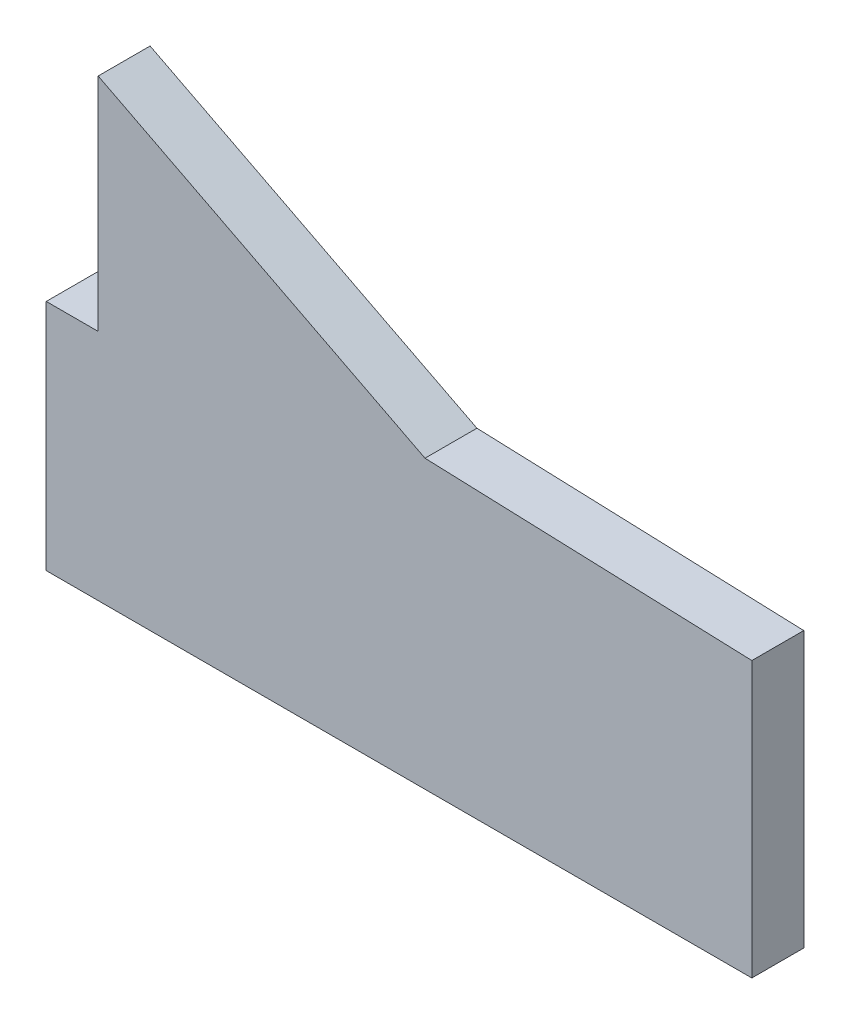
ISO-10303-21;
HEADER;
FILE_DESCRIPTION(('STEP AP214'),'2;1');
FILE_NAME('part.step','',(''),(''),'','','');
FILE_SCHEMA(('AUTOMOTIVE_DESIGN { 1 0 10303 214 1 1 1 1 }'));
ENDSEC;
DATA;
#1=APPLICATION_CONTEXT('core data for automotive mechanical design processes');
#2=APPLICATION_PROTOCOL_DEFINITION('international standard','automotive_design',2000,#1);
#3=PRODUCT_CONTEXT('',#1,'mechanical');
#4=PRODUCT('Part','Part','',(#3));
#5=PRODUCT_RELATED_PRODUCT_CATEGORY('part','',(#4));
#6=PRODUCT_DEFINITION_FORMATION('','',#4);
#7=PRODUCT_DEFINITION_CONTEXT('part definition',#1,'design');
#8=PRODUCT_DEFINITION('design','',#6,#7);
#9=PRODUCT_DEFINITION_SHAPE('','',#8);
#10=(LENGTH_UNIT() NAMED_UNIT(*) SI_UNIT(.MILLI.,.METRE.));
#11=(NAMED_UNIT(*) PLANE_ANGLE_UNIT() SI_UNIT($,.RADIAN.));
#12=(NAMED_UNIT(*) SI_UNIT($,.STERADIAN.) SOLID_ANGLE_UNIT());
#13=UNCERTAINTY_MEASURE_WITH_UNIT(LENGTH_MEASURE(1.E-05),#10,'distance_accuracy_value','');
#14=(GEOMETRIC_REPRESENTATION_CONTEXT(3) GLOBAL_UNCERTAINTY_ASSIGNED_CONTEXT((#13)) GLOBAL_UNIT_ASSIGNED_CONTEXT((#10,
#11,#12)) REPRESENTATION_CONTEXT('',''));
#15=CARTESIAN_POINT('',(0.,0.,0.));
#16=DIRECTION('',(0.,0.,1.));
#17=DIRECTION('',(1.,0.,0.));
#18=AXIS2_PLACEMENT_3D('',#15,#16,#17);
#19=CARTESIAN_POINT('',(46.499999964,78.74,56.2156621963594));
#20=DIRECTION('',(0.456287614254953,0.889832351107512,0.));
#21=DIRECTION('',(0.,0.,-1.));
#22=AXIS2_PLACEMENT_3D('',#19,#20,#21);
#23=PLANE('',#22);
#24=DIRECTION('',(0.889832351107513,-0.456287614254953,0.));
#25=VECTOR('',#24,1.);
#26=CARTESIAN_POINT('',(46.499999964,78.74,146.05));
#27=LINE('',#26,#25);
#28=CARTESIAN_POINT('',(46.499999964,78.74,146.05));
#29=VERTEX_POINT('',#28);
#30=CARTESIAN_POINT('',(126.437499982,37.7497043254033,146.05));
#31=VERTEX_POINT('',#30);
#32=EDGE_CURVE('E10',#29,#31,#27,.T.);
#33=ORIENTED_EDGE('',*,*,#32,.F.);
#34=DIRECTION('',(0.,0.,1.));
#35=VECTOR('',#34,1.);
#36=CARTESIAN_POINT('',(46.499999964,78.74,56.2156621963594));
#37=LINE('',#36,#35);
#38=CARTESIAN_POINT('',(46.499999964,78.74,158.75));
#39=VERTEX_POINT('',#38);
#40=EDGE_CURVE('E128',#29,#39,#37,.T.);
#41=ORIENTED_EDGE('',*,*,#40,.T.);
#42=DIRECTION('',(-0.889832351107513,0.456287614254953,0.));
#43=VECTOR('',#42,1.);
#44=CARTESIAN_POINT('',(46.499999964,78.74,158.75));
#45=LINE('',#44,#43);
#46=CARTESIAN_POINT('',(126.437499982,37.7497043254033,158.75));
#47=VERTEX_POINT('',#46);
#48=EDGE_CURVE('E26',#47,#39,#45,.T.);
#49=ORIENTED_EDGE('',*,*,#48,.F.);
#50=DIRECTION('',(0.,0.,1.));
#51=VECTOR('',#50,1.);
#52=CARTESIAN_POINT('',(126.437499982,37.7497043254033,56.2156621963594));
#53=LINE('',#52,#51);
#54=EDGE_CURVE('E157',#31,#47,#53,.T.);
#55=ORIENTED_EDGE('',*,*,#54,.F.);
#56=EDGE_LOOP('',(#33,#41,#49,#55));
#57=FACE_BOUND('',#56,.T.);
#58=ADVANCED_FACE('F15',(#57),#23,.T.);
#59=CARTESIAN_POINT('',(0.,0.,146.05));
#60=DIRECTION('',(0.,0.,1.));
#61=DIRECTION('',(1.,0.,0.));
#62=AXIS2_PLACEMENT_3D('',#59,#60,#61);
#63=PLANE('',#62);
#64=DIRECTION('',(0.,-1.,0.));
#65=VECTOR('',#64,1.);
#66=CARTESIAN_POINT('',(33.799999964,24.638,146.05));
#67=LINE('',#66,#65);
#68=CARTESIAN_POINT('',(33.799999964,24.638,146.05));
#69=VERTEX_POINT('',#68);
#70=CARTESIAN_POINT('',(33.799999964,-32.385,146.05));
#71=VERTEX_POINT('',#70);
#72=EDGE_CURVE('E94',#69,#71,#67,.T.);
#73=ORIENTED_EDGE('',*,*,#72,.F.);
#74=DIRECTION('',(-1.,0.,0.));
#75=VECTOR('',#74,1.);
#76=CARTESIAN_POINT('',(46.499999964,24.638,146.05));
#77=LINE('',#76,#75);
#78=CARTESIAN_POINT('',(46.499999964,24.638,146.05));
#79=VERTEX_POINT('',#78);
#80=EDGE_CURVE('E138',#79,#69,#77,.T.);
#81=ORIENTED_EDGE('',*,*,#80,.F.);
#82=DIRECTION('',(0.,-1.,0.));
#83=VECTOR('',#82,1.);
#84=CARTESIAN_POINT('',(46.499999964,40.64,146.05));
#85=LINE('',#84,#83);
#86=EDGE_CURVE('E19',#29,#79,#85,.T.);
#87=ORIENTED_EDGE('',*,*,#86,.F.);
#88=ORIENTED_EDGE('',*,*,#32,.T.);
#89=DIRECTION('',(-0.999346977931186,0.0361333322543911,0.));
#90=VECTOR('',#89,1.);
#91=CARTESIAN_POINT('',(206.375,34.8594086508066,146.05));
#92=LINE('',#91,#90);
#93=CARTESIAN_POINT('',(206.375,34.8594086508066,146.05));
#94=VERTEX_POINT('',#93);
#95=EDGE_CURVE('E156',#94,#31,#92,.T.);
#96=ORIENTED_EDGE('',*,*,#95,.F.);
#97=DIRECTION('',(0.,1.,0.));
#98=VECTOR('',#97,1.);
#99=CARTESIAN_POINT('',(206.375,-32.385,146.05));
#100=LINE('',#99,#98);
#101=CARTESIAN_POINT('',(206.375,-32.385,146.05));
#102=VERTEX_POINT('',#101);
#103=EDGE_CURVE('E96',#102,#94,#100,.T.);
#104=ORIENTED_EDGE('',*,*,#103,.F.);
#105=DIRECTION('',(1.,0.,0.));
#106=VECTOR('',#105,1.);
#107=CARTESIAN_POINT('',(33.799999964,-32.385,146.05));
#108=LINE('',#107,#106);
#109=EDGE_CURVE('E90',#71,#102,#108,.T.);
#110=ORIENTED_EDGE('',*,*,#109,.F.);
#111=EDGE_LOOP('',(#73,#81,#87,#88,#96,#104,#110));
#112=FACE_BOUND('',#111,.T.);
#113=ADVANCED_FACE('F92',(#112),#63,.F.);
#114=CARTESIAN_POINT('',(0.,0.,158.75));
#115=DIRECTION('',(0.,0.,1.));
#116=DIRECTION('',(1.,0.,0.));
#117=AXIS2_PLACEMENT_3D('',#114,#115,#116);
#118=PLANE('',#117);
#119=DIRECTION('',(0.,-1.,0.));
#120=VECTOR('',#119,1.);
#121=CARTESIAN_POINT('',(33.799999964,24.638,158.75));
#122=LINE('',#121,#120);
#123=CARTESIAN_POINT('',(33.799999964,24.638,158.75));
#124=VERTEX_POINT('',#123);
#125=CARTESIAN_POINT('',(33.799999964,-32.385,158.75));
#126=VERTEX_POINT('',#125);
#127=EDGE_CURVE('E113',#124,#126,#122,.T.);
#128=ORIENTED_EDGE('',*,*,#127,.T.);
#129=DIRECTION('',(1.,0.,0.));
#130=VECTOR('',#129,1.);
#131=CARTESIAN_POINT('',(33.799999964,-32.385,158.75));
#132=LINE('',#131,#130);
#133=CARTESIAN_POINT('',(206.375,-32.385,158.75));
#134=VERTEX_POINT('',#133);
#135=EDGE_CURVE('E108',#126,#134,#132,.T.);
#136=ORIENTED_EDGE('',*,*,#135,.T.);
#137=DIRECTION('',(0.,1.,0.));
#138=VECTOR('',#137,1.);
#139=CARTESIAN_POINT('',(206.375,-32.385,158.75));
#140=LINE('',#139,#138);
#141=CARTESIAN_POINT('',(206.375,34.8594086508066,158.75));
#142=VERTEX_POINT('',#141);
#143=EDGE_CURVE('E134',#134,#142,#140,.T.);
#144=ORIENTED_EDGE('',*,*,#143,.T.);
#145=DIRECTION('',(-0.999346977931186,0.0361333322543911,0.));
#146=VECTOR('',#145,1.);
#147=CARTESIAN_POINT('',(206.375,34.8594086508066,158.75));
#148=LINE('',#147,#146);
#149=EDGE_CURVE('E161',#142,#47,#148,.T.);
#150=ORIENTED_EDGE('',*,*,#149,.T.);
#151=ORIENTED_EDGE('',*,*,#48,.T.);
#152=DIRECTION('',(0.,-1.,0.));
#153=VECTOR('',#152,1.);
#154=CARTESIAN_POINT('',(46.499999964,40.64,158.75));
#155=LINE('',#154,#153);
#156=CARTESIAN_POINT('',(46.499999964,24.638,158.75));
#157=VERTEX_POINT('',#156);
#158=EDGE_CURVE('E125',#39,#157,#155,.T.);
#159=ORIENTED_EDGE('',*,*,#158,.T.);
#160=DIRECTION('',(-1.,0.,0.));
#161=VECTOR('',#160,1.);
#162=CARTESIAN_POINT('',(46.499999964,24.638,158.75));
#163=LINE('',#162,#161);
#164=EDGE_CURVE('E141',#157,#124,#163,.T.);
#165=ORIENTED_EDGE('',*,*,#164,.T.);
#166=EDGE_LOOP('',(#128,#136,#144,#150,#151,#159,#165));
#167=FACE_BOUND('',#166,.T.);
#168=ADVANCED_FACE('F17',(#167),#118,.T.);
#169=CARTESIAN_POINT('',(46.499999964,24.638,158.75));
#170=DIRECTION('',(0.,-1.,0.));
#171=DIRECTION('',(0.,0.,-1.));
#172=AXIS2_PLACEMENT_3D('',#169,#170,#171);
#173=PLANE('',#172);
#174=ORIENTED_EDGE('',*,*,#80,.T.);
#175=DIRECTION('',(0.,0.,-1.));
#176=VECTOR('',#175,1.);
#177=CARTESIAN_POINT('',(33.799999964,24.638,158.75));
#178=LINE('',#177,#176);
#179=EDGE_CURVE('E102',#124,#69,#178,.T.);
#180=ORIENTED_EDGE('',*,*,#179,.F.);
#181=ORIENTED_EDGE('',*,*,#164,.F.);
#182=DIRECTION('',(0.,0.,-1.));
#183=VECTOR('',#182,1.);
#184=CARTESIAN_POINT('',(46.499999964,24.638,158.75));
#185=LINE('',#184,#183);
#186=EDGE_CURVE('E129',#157,#79,#185,.T.);
#187=ORIENTED_EDGE('',*,*,#186,.T.);
#188=EDGE_LOOP('',(#174,#180,#181,#187));
#189=FACE_BOUND('',#188,.T.);
#190=ADVANCED_FACE('F293',(#189),#173,.F.);
#191=CARTESIAN_POINT('',(46.499999964,40.64,158.75));
#192=DIRECTION('',(1.,0.,0.));
#193=DIRECTION('',(0.,1.,0.));
#194=AXIS2_PLACEMENT_3D('',#191,#192,#193);
#195=PLANE('',#194);
#196=ORIENTED_EDGE('',*,*,#86,.T.);
#197=ORIENTED_EDGE('',*,*,#186,.F.);
#198=ORIENTED_EDGE('',*,*,#158,.F.);
#199=ORIENTED_EDGE('',*,*,#40,.F.);
#200=EDGE_LOOP('',(#196,#197,#198,#199));
#201=FACE_BOUND('',#200,.T.);
#202=ADVANCED_FACE('F316',(#201),#195,.F.);
#203=CARTESIAN_POINT('',(206.375,34.8594086508066,158.75));
#204=DIRECTION('',(-0.0361333322543911,-0.999346977931186,0.));
#205=DIRECTION('',(-0.999346977931186,0.0361333322543911,0.));
#206=AXIS2_PLACEMENT_3D('',#203,#204,#205);
#207=PLANE('',#206);
#208=ORIENTED_EDGE('',*,*,#95,.T.);
#209=ORIENTED_EDGE('',*,*,#54,.T.);
#210=ORIENTED_EDGE('',*,*,#149,.F.);
#211=DIRECTION('',(0.,0.,-1.));
#212=VECTOR('',#211,1.);
#213=CARTESIAN_POINT('',(206.375,34.8594086508066,158.75));
#214=LINE('',#213,#212);
#215=EDGE_CURVE('E130',#142,#94,#214,.T.);
#216=ORIENTED_EDGE('',*,*,#215,.T.);
#217=EDGE_LOOP('',(#208,#209,#210,#216));
#218=FACE_BOUND('',#217,.T.);
#219=ADVANCED_FACE('F179',(#218),#207,.F.);
#220=CARTESIAN_POINT('',(206.375,-32.385,158.75));
#221=DIRECTION('',(-1.,0.,0.));
#222=DIRECTION('',(0.,0.,1.));
#223=AXIS2_PLACEMENT_3D('',#220,#221,#222);
#224=PLANE('',#223);
#225=ORIENTED_EDGE('',*,*,#103,.T.);
#226=ORIENTED_EDGE('',*,*,#215,.F.);
#227=ORIENTED_EDGE('',*,*,#143,.F.);
#228=DIRECTION('',(0.,0.,-1.));
#229=VECTOR('',#228,1.);
#230=CARTESIAN_POINT('',(206.375,-32.385,158.75));
#231=LINE('',#230,#229);
#232=EDGE_CURVE('E101',#134,#102,#231,.T.);
#233=ORIENTED_EDGE('',*,*,#232,.T.);
#234=EDGE_LOOP('',(#225,#226,#227,#233));
#235=FACE_BOUND('',#234,.T.);
#236=ADVANCED_FACE('F175',(#235),#224,.F.);
#237=CARTESIAN_POINT('',(33.799999964,-32.385,158.75));
#238=DIRECTION('',(0.,1.,0.));
#239=DIRECTION('',(1.,0.,0.));
#240=AXIS2_PLACEMENT_3D('',#237,#238,#239);
#241=PLANE('',#240);
#242=ORIENTED_EDGE('',*,*,#109,.T.);
#243=ORIENTED_EDGE('',*,*,#232,.F.);
#244=ORIENTED_EDGE('',*,*,#135,.F.);
#245=DIRECTION('',(0.,0.,-1.));
#246=VECTOR('',#245,1.);
#247=CARTESIAN_POINT('',(33.799999964,-32.385,158.75));
#248=LINE('',#247,#246);
#249=EDGE_CURVE('E105',#126,#71,#248,.T.);
#250=ORIENTED_EDGE('',*,*,#249,.T.);
#251=EDGE_LOOP('',(#242,#243,#244,#250));
#252=FACE_BOUND('',#251,.T.);
#253=ADVANCED_FACE('F106',(#252),#241,.F.);
#254=CARTESIAN_POINT('',(33.799999964,24.638,158.75));
#255=DIRECTION('',(1.,0.,0.));
#256=DIRECTION('',(0.,1.,0.));
#257=AXIS2_PLACEMENT_3D('',#254,#255,#256);
#258=PLANE('',#257);
#259=ORIENTED_EDGE('',*,*,#72,.T.);
#260=ORIENTED_EDGE('',*,*,#249,.F.);
#261=ORIENTED_EDGE('',*,*,#127,.F.);
#262=ORIENTED_EDGE('',*,*,#179,.T.);
#263=EDGE_LOOP('',(#259,#260,#261,#262));
#264=FACE_BOUND('',#263,.T.);
#265=ADVANCED_FACE('F116',(#264),#258,.F.);
#266=CLOSED_SHELL('',(#58,#113,#168,#190,#202,#219,#236,#253,#265));
#267=MANIFOLD_SOLID_BREP('B1',#266);
#268=ADVANCED_BREP_SHAPE_REPRESENTATION('',(#18,#267),#14);
#269=SHAPE_DEFINITION_REPRESENTATION(#9,#268);
ENDSEC;
END-ISO-10303-21;
